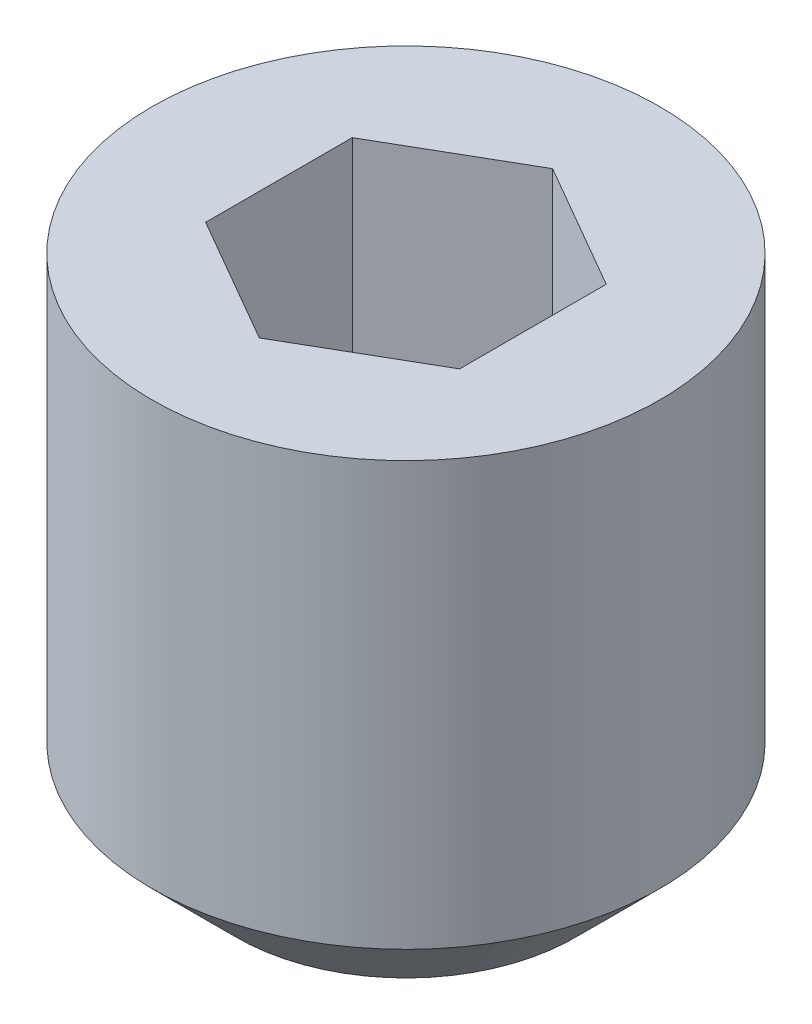
ISO-10303-21;
HEADER;
FILE_DESCRIPTION(('STEP AP214'),'2;1');
FILE_NAME('part.step','',(''),(''),'','','');
FILE_SCHEMA(('AUTOMOTIVE_DESIGN { 1 0 10303 214 1 1 1 1 }'));
ENDSEC;
DATA;
#1=APPLICATION_CONTEXT('core data for automotive mechanical design processes');
#2=APPLICATION_PROTOCOL_DEFINITION('international standard','automotive_design',2000,#1);
#3=PRODUCT_CONTEXT('',#1,'mechanical');
#4=PRODUCT('Part','Part','',(#3));
#5=PRODUCT_RELATED_PRODUCT_CATEGORY('part','',(#4));
#6=PRODUCT_DEFINITION_FORMATION('','',#4);
#7=PRODUCT_DEFINITION_CONTEXT('part definition',#1,'design');
#8=PRODUCT_DEFINITION('design','',#6,#7);
#9=PRODUCT_DEFINITION_SHAPE('','',#8);
#10=(LENGTH_UNIT() NAMED_UNIT(*) SI_UNIT(.MILLI.,.METRE.));
#11=(NAMED_UNIT(*) PLANE_ANGLE_UNIT() SI_UNIT($,.RADIAN.));
#12=(NAMED_UNIT(*) SI_UNIT($,.STERADIAN.) SOLID_ANGLE_UNIT());
#13=UNCERTAINTY_MEASURE_WITH_UNIT(LENGTH_MEASURE(1.E-05),#10,'distance_accuracy_value','');
#14=(GEOMETRIC_REPRESENTATION_CONTEXT(3) GLOBAL_UNCERTAINTY_ASSIGNED_CONTEXT((#13)) GLOBAL_UNIT_ASSIGNED_CONTEXT((#10,
#11,#12)) REPRESENTATION_CONTEXT('',''));
#15=CARTESIAN_POINT('',(0.,0.,0.));
#16=DIRECTION('',(0.,0.,1.));
#17=DIRECTION('',(1.,0.,0.));
#18=AXIS2_PLACEMENT_3D('',#15,#16,#17);
#19=CARTESIAN_POINT('',(0.,3.,0.));
#20=DIRECTION('',(0.,1.,0.));
#21=DIRECTION('',(-1.,0.,0.));
#22=AXIS2_PLACEMENT_3D('',#19,#20,#21);
#23=CYLINDRICAL_SURFACE('',#22,1.5);
#24=CARTESIAN_POINT('',(0.,3.,0.));
#25=DIRECTION('',(0.,1.,0.));
#26=DIRECTION('',(-1.,0.,0.));
#27=AXIS2_PLACEMENT_3D('',#24,#25,#26);
#28=CIRCLE('',#27,1.5);
#29=CARTESIAN_POINT('',(-1.5,3.,0.));
#30=VERTEX_POINT('',#29);
#31=EDGE_CURVE('E11',#30,#30,#28,.T.);
#32=ORIENTED_EDGE('',*,*,#31,.F.);
#33=EDGE_LOOP('',(#32));
#34=FACE_BOUND('',#33,.T.);
#35=CARTESIAN_POINT('',(0.,0.499999999999995,0.));
#36=DIRECTION('',(0.,1.,0.));
#37=DIRECTION('',(-1.,0.,0.));
#38=AXIS2_PLACEMENT_3D('',#35,#36,#37);
#39=CIRCLE('',#38,1.5);
#40=CARTESIAN_POINT('',(-1.5,0.499999999999995,0.));
#41=VERTEX_POINT('',#40);
#42=EDGE_CURVE('E152',#41,#41,#39,.T.);
#43=ORIENTED_EDGE('',*,*,#42,.T.);
#44=EDGE_LOOP('',(#43));
#45=FACE_BOUND('',#44,.T.);
#46=ADVANCED_FACE('F36',(#34,#45),#23,.T.);
#47=CARTESIAN_POINT('',(0.,3.,0.));
#48=DIRECTION('',(0.,-1.,0.));
#49=DIRECTION('',(1.,0.,0.));
#50=AXIS2_PLACEMENT_3D('',#47,#48,#49);
#51=PLANE('',#50);
#52=ORIENTED_EDGE('',*,*,#31,.T.);
#53=EDGE_LOOP('',(#52));
#54=FACE_BOUND('',#53,.T.);
#55=DIRECTION('',(-0.866025403784438,0.,0.5));
#56=VECTOR('',#55,1.);
#57=CARTESIAN_POINT('',(0.,3.,-0.866025403784438));
#58=LINE('',#57,#56);
#59=CARTESIAN_POINT('',(0.,3.,-0.866025403784439));
#60=VERTEX_POINT('',#59);
#61=CARTESIAN_POINT('',(-0.75,3.,-0.433012701892219));
#62=VERTEX_POINT('',#61);
#63=EDGE_CURVE('E151',#60,#62,#58,.T.);
#64=ORIENTED_EDGE('',*,*,#63,.F.);
#65=DIRECTION('',(-0.866025403784439,0.,-0.5));
#66=VECTOR('',#65,1.);
#67=CARTESIAN_POINT('',(0.75,3.,-0.43301270189222));
#68=LINE('',#67,#66);
#69=CARTESIAN_POINT('',(0.75,3.,-0.43301270189222));
#70=VERTEX_POINT('',#69);
#71=EDGE_CURVE('E51',#70,#60,#68,.T.);
#72=ORIENTED_EDGE('',*,*,#71,.F.);
#73=DIRECTION('',(0.,0.,-1.));
#74=VECTOR('',#73,1.);
#75=CARTESIAN_POINT('',(0.75,3.,0.433012701892219));
#76=LINE('',#75,#74);
#77=CARTESIAN_POINT('',(0.75,3.,0.433012701892219));
#78=VERTEX_POINT('',#77);
#79=EDGE_CURVE('E121',#78,#70,#76,.T.);
#80=ORIENTED_EDGE('',*,*,#79,.F.);
#81=DIRECTION('',(0.866025403784439,0.,-0.5));
#82=VECTOR('',#81,1.);
#83=CARTESIAN_POINT('',(0.,3.,0.866025403784438));
#84=LINE('',#83,#82);
#85=CARTESIAN_POINT('',(0.,3.,0.866025403784438));
#86=VERTEX_POINT('',#85);
#87=EDGE_CURVE('E159',#86,#78,#84,.T.);
#88=ORIENTED_EDGE('',*,*,#87,.F.);
#89=DIRECTION('',(0.866025403784439,0.,0.5));
#90=VECTOR('',#89,1.);
#91=CARTESIAN_POINT('',(-0.75,3.,0.433012701892219));
#92=LINE('',#91,#90);
#93=CARTESIAN_POINT('',(-0.75,3.,0.433012701892219));
#94=VERTEX_POINT('',#93);
#95=EDGE_CURVE('E156',#94,#86,#92,.T.);
#96=ORIENTED_EDGE('',*,*,#95,.F.);
#97=DIRECTION('',(0.,0.,1.));
#98=VECTOR('',#97,1.);
#99=CARTESIAN_POINT('',(-0.75,3.,-0.433012701892219));
#100=LINE('',#99,#98);
#101=EDGE_CURVE('E154',#62,#94,#100,.T.);
#102=ORIENTED_EDGE('',*,*,#101,.F.);
#103=EDGE_LOOP('',(#64,#72,#80,#88,#96,#102));
#104=FACE_BOUND('',#103,.T.);
#105=ADVANCED_FACE('F201',(#54,#104),#51,.F.);
#106=CARTESIAN_POINT('',(0.75,1.8,-0.43301270189222));
#107=DIRECTION('',(0.5,0.,-0.866025403784439));
#108=DIRECTION('',(-0.866025403784439,0.,-0.5));
#109=AXIS2_PLACEMENT_3D('',#106,#107,#108);
#110=PLANE('',#109);
#111=DIRECTION('',(-0.866025403784439,0.,-0.5));
#112=VECTOR('',#111,1.);
#113=CARTESIAN_POINT('',(0.75,1.8,-0.43301270189222));
#114=LINE('',#113,#112);
#115=CARTESIAN_POINT('',(0.75,1.8,-0.43301270189222));
#116=VERTEX_POINT('',#115);
#117=CARTESIAN_POINT('',(0.375,1.8,-0.649519052838329));
#118=VERTEX_POINT('',#117);
#119=EDGE_CURVE('E120',#116,#118,#114,.T.);
#120=ORIENTED_EDGE('',*,*,#119,.F.);
#121=DIRECTION('',(0.,1.,0.));
#122=VECTOR('',#121,1.);
#123=CARTESIAN_POINT('',(0.75,1.8,-0.43301270189222));
#124=LINE('',#123,#122);
#125=EDGE_CURVE('E162',#116,#70,#124,.T.);
#126=ORIENTED_EDGE('',*,*,#125,.T.);
#127=ORIENTED_EDGE('',*,*,#71,.T.);
#128=DIRECTION('',(0.,1.,0.));
#129=VECTOR('',#128,1.);
#130=CARTESIAN_POINT('',(0.,1.8,-0.866025403784438));
#131=LINE('',#130,#129);
#132=CARTESIAN_POINT('',(0.,1.8,-0.866025403784438));
#133=VERTEX_POINT('',#132);
#134=EDGE_CURVE('E123',#133,#60,#131,.T.);
#135=ORIENTED_EDGE('',*,*,#134,.F.);
#136=EDGE_CURVE('E112',#118,#133,#114,.T.);
#137=ORIENTED_EDGE('',*,*,#136,.F.);
#138=EDGE_LOOP('',(#120,#126,#127,#135,#137));
#139=FACE_BOUND('',#138,.T.);
#140=ADVANCED_FACE('F124',(#139),#110,.F.);
#141=CARTESIAN_POINT('',(0.75,1.8,0.433012701892219));
#142=DIRECTION('',(1.,0.,0.));
#143=DIRECTION('',(0.,1.,0.));
#144=AXIS2_PLACEMENT_3D('',#141,#142,#143);
#145=PLANE('',#144);
#146=DIRECTION('',(0.,0.,-1.));
#147=VECTOR('',#146,1.);
#148=CARTESIAN_POINT('',(0.75,1.8,0.433012701892219));
#149=LINE('',#148,#147);
#150=CARTESIAN_POINT('',(0.75,1.8,0.433012701892219));
#151=VERTEX_POINT('',#150);
#152=CARTESIAN_POINT('',(0.75,1.8,0.));
#153=VERTEX_POINT('',#152);
#154=EDGE_CURVE('E128',#151,#153,#149,.T.);
#155=ORIENTED_EDGE('',*,*,#154,.F.);
#156=DIRECTION('',(0.,1.,0.));
#157=VECTOR('',#156,1.);
#158=CARTESIAN_POINT('',(0.75,1.8,0.433012701892219));
#159=LINE('',#158,#157);
#160=EDGE_CURVE('E165',#151,#78,#159,.T.);
#161=ORIENTED_EDGE('',*,*,#160,.T.);
#162=ORIENTED_EDGE('',*,*,#79,.T.);
#163=ORIENTED_EDGE('',*,*,#125,.F.);
#164=EDGE_CURVE('E147',#153,#116,#149,.T.);
#165=ORIENTED_EDGE('',*,*,#164,.F.);
#166=EDGE_LOOP('',(#155,#161,#162,#163,#165));
#167=FACE_BOUND('',#166,.T.);
#168=ADVANCED_FACE('F193',(#167),#145,.F.);
#169=CARTESIAN_POINT('',(0.,1.8,0.866025403784438));
#170=DIRECTION('',(0.5,0.,0.866025403784439));
#171=DIRECTION('',(0.866025403784439,0.,-0.5));
#172=AXIS2_PLACEMENT_3D('',#169,#170,#171);
#173=PLANE('',#172);
#174=DIRECTION('',(0.866025403784439,0.,-0.5));
#175=VECTOR('',#174,1.);
#176=CARTESIAN_POINT('',(0.,1.8,0.866025403784438));
#177=LINE('',#176,#175);
#178=CARTESIAN_POINT('',(0.,1.8,0.866025403784438));
#179=VERTEX_POINT('',#178);
#180=CARTESIAN_POINT('',(0.375,1.8,0.649519052838329));
#181=VERTEX_POINT('',#180);
#182=EDGE_CURVE('E59',#179,#181,#177,.T.);
#183=ORIENTED_EDGE('',*,*,#182,.F.);
#184=DIRECTION('',(0.,1.,0.));
#185=VECTOR('',#184,1.);
#186=CARTESIAN_POINT('',(0.,1.8,0.866025403784438));
#187=LINE('',#186,#185);
#188=EDGE_CURVE('E168',#179,#86,#187,.T.);
#189=ORIENTED_EDGE('',*,*,#188,.T.);
#190=ORIENTED_EDGE('',*,*,#87,.T.);
#191=ORIENTED_EDGE('',*,*,#160,.F.);
#192=EDGE_CURVE('E145',#181,#151,#177,.T.);
#193=ORIENTED_EDGE('',*,*,#192,.F.);
#194=EDGE_LOOP('',(#183,#189,#190,#191,#193));
#195=FACE_BOUND('',#194,.T.);
#196=ADVANCED_FACE('F198',(#195),#173,.F.);
#197=CARTESIAN_POINT('',(-0.75,1.8,0.433012701892219));
#198=DIRECTION('',(-0.5,0.,0.866025403784439));
#199=DIRECTION('',(0.866025403784439,0.,0.5));
#200=AXIS2_PLACEMENT_3D('',#197,#198,#199);
#201=PLANE('',#200);
#202=DIRECTION('',(0.866025403784439,0.,0.5));
#203=VECTOR('',#202,1.);
#204=CARTESIAN_POINT('',(-0.75,1.8,0.433012701892219));
#205=LINE('',#204,#203);
#206=CARTESIAN_POINT('',(-0.75,1.8,0.433012701892219));
#207=VERTEX_POINT('',#206);
#208=CARTESIAN_POINT('',(-0.375,1.8,0.649519052838329));
#209=VERTEX_POINT('',#208);
#210=EDGE_CURVE('E142',#207,#209,#205,.T.);
#211=ORIENTED_EDGE('',*,*,#210,.F.);
#212=DIRECTION('',(0.,1.,0.));
#213=VECTOR('',#212,1.);
#214=CARTESIAN_POINT('',(-0.75,1.8,0.433012701892219));
#215=LINE('',#214,#213);
#216=EDGE_CURVE('E171',#207,#94,#215,.T.);
#217=ORIENTED_EDGE('',*,*,#216,.T.);
#218=ORIENTED_EDGE('',*,*,#95,.T.);
#219=ORIENTED_EDGE('',*,*,#188,.F.);
#220=EDGE_CURVE('E141',#209,#179,#205,.T.);
#221=ORIENTED_EDGE('',*,*,#220,.F.);
#222=EDGE_LOOP('',(#211,#217,#218,#219,#221));
#223=FACE_BOUND('',#222,.T.);
#224=ADVANCED_FACE('F241',(#223),#201,.F.);
#225=CARTESIAN_POINT('',(-0.75,1.8,-0.433012701892219));
#226=DIRECTION('',(-1.,0.,0.));
#227=DIRECTION('',(0.,0.,1.));
#228=AXIS2_PLACEMENT_3D('',#225,#226,#227);
#229=PLANE('',#228);
#230=DIRECTION('',(0.,0.,1.));
#231=VECTOR('',#230,1.);
#232=CARTESIAN_POINT('',(-0.75,1.8,-0.433012701892219));
#233=LINE('',#232,#231);
#234=CARTESIAN_POINT('',(-0.75,1.8,-0.433012701892219));
#235=VERTEX_POINT('',#234);
#236=CARTESIAN_POINT('',(-0.75,1.8,0.));
#237=VERTEX_POINT('',#236);
#238=EDGE_CURVE('E136',#235,#237,#233,.T.);
#239=ORIENTED_EDGE('',*,*,#238,.F.);
#240=DIRECTION('',(0.,1.,0.));
#241=VECTOR('',#240,1.);
#242=CARTESIAN_POINT('',(-0.75,1.8,-0.433012701892219));
#243=LINE('',#242,#241);
#244=EDGE_CURVE('E127',#235,#62,#243,.T.);
#245=ORIENTED_EDGE('',*,*,#244,.T.);
#246=ORIENTED_EDGE('',*,*,#101,.T.);
#247=ORIENTED_EDGE('',*,*,#216,.F.);
#248=EDGE_CURVE('E134',#237,#207,#233,.T.);
#249=ORIENTED_EDGE('',*,*,#248,.F.);
#250=EDGE_LOOP('',(#239,#245,#246,#247,#249));
#251=FACE_BOUND('',#250,.T.);
#252=ADVANCED_FACE('F206',(#251),#229,.F.);
#253=CARTESIAN_POINT('',(0.,1.8,-0.866025403784438));
#254=DIRECTION('',(-0.5,0.,-0.866025403784439));
#255=DIRECTION('',(-0.866025403784439,0.,0.5));
#256=AXIS2_PLACEMENT_3D('',#253,#254,#255);
#257=PLANE('',#256);
#258=DIRECTION('',(-0.866025403784438,0.,0.5));
#259=VECTOR('',#258,1.);
#260=CARTESIAN_POINT('',(0.,1.8,-0.866025403784438));
#261=LINE('',#260,#259);
#262=CARTESIAN_POINT('',(-0.375,1.8,-0.649519052838329));
#263=VERTEX_POINT('',#262);
#264=EDGE_CURVE('E115',#133,#263,#261,.T.);
#265=ORIENTED_EDGE('',*,*,#264,.F.);
#266=ORIENTED_EDGE('',*,*,#134,.T.);
#267=ORIENTED_EDGE('',*,*,#63,.T.);
#268=ORIENTED_EDGE('',*,*,#244,.F.);
#269=EDGE_CURVE('E133',#263,#235,#261,.T.);
#270=ORIENTED_EDGE('',*,*,#269,.F.);
#271=EDGE_LOOP('',(#265,#266,#267,#268,#270));
#272=FACE_BOUND('',#271,.T.);
#273=ADVANCED_FACE('F131',(#272),#257,.F.);
#274=CARTESIAN_POINT('',(0.,1.8,0.));
#275=DIRECTION('',(0.,1.,0.));
#276=DIRECTION('',(0.,0.,1.));
#277=AXIS2_PLACEMENT_3D('',#274,#275,#276);
#278=PLANE('',#277);
#279=ORIENTED_EDGE('',*,*,#192,.T.);
#280=ORIENTED_EDGE('',*,*,#154,.T.);
#281=CARTESIAN_POINT('',(0.,1.8,0.));
#282=DIRECTION('',(0.,1.,0.));
#283=DIRECTION('',(0.,0.,1.));
#284=AXIS2_PLACEMENT_3D('',#281,#282,#283);
#285=CIRCLE('',#284,0.75);
#286=EDGE_CURVE('E44',#181,#153,#285,.T.);
#287=ORIENTED_EDGE('',*,*,#286,.F.);
#288=EDGE_LOOP('',(#279,#280,#287));
#289=FACE_BOUND('',#288,.T.);
#290=ADVANCED_FACE('F195',(#289),#278,.T.);
#291=ORIENTED_EDGE('',*,*,#164,.T.);
#292=ORIENTED_EDGE('',*,*,#119,.T.);
#293=EDGE_CURVE('E176',#153,#118,#285,.T.);
#294=ORIENTED_EDGE('',*,*,#293,.F.);
#295=EDGE_LOOP('',(#291,#292,#294));
#296=FACE_BOUND('',#295,.T.);
#297=ADVANCED_FACE('F189',(#296),#278,.T.);
#298=ORIENTED_EDGE('',*,*,#136,.T.);
#299=ORIENTED_EDGE('',*,*,#264,.T.);
#300=EDGE_CURVE('E117',#118,#263,#285,.T.);
#301=ORIENTED_EDGE('',*,*,#300,.F.);
#302=EDGE_LOOP('',(#298,#299,#301));
#303=FACE_BOUND('',#302,.T.);
#304=ADVANCED_FACE('F113',(#303),#278,.T.);
#305=ORIENTED_EDGE('',*,*,#269,.T.);
#306=ORIENTED_EDGE('',*,*,#238,.T.);
#307=EDGE_CURVE('E183',#263,#237,#285,.T.);
#308=ORIENTED_EDGE('',*,*,#307,.F.);
#309=EDGE_LOOP('',(#305,#306,#308));
#310=FACE_BOUND('',#309,.T.);
#311=ADVANCED_FACE('F210',(#310),#278,.T.);
#312=ORIENTED_EDGE('',*,*,#248,.T.);
#313=ORIENTED_EDGE('',*,*,#210,.T.);
#314=EDGE_CURVE('E181',#237,#209,#285,.T.);
#315=ORIENTED_EDGE('',*,*,#314,.F.);
#316=EDGE_LOOP('',(#312,#313,#315));
#317=FACE_BOUND('',#316,.T.);
#318=ADVANCED_FACE('F212',(#317),#278,.T.);
#319=ORIENTED_EDGE('',*,*,#220,.T.);
#320=ORIENTED_EDGE('',*,*,#182,.T.);
#321=EDGE_CURVE('E164',#209,#181,#285,.T.);
#322=ORIENTED_EDGE('',*,*,#321,.F.);
#323=EDGE_LOOP('',(#319,#320,#322));
#324=FACE_BOUND('',#323,.T.);
#325=ADVANCED_FACE('F218',(#324),#278,.T.);
#326=CARTESIAN_POINT('',(0.,1.36698729810778,0.));
#327=DIRECTION('',(0.,1.,0.));
#328=DIRECTION('',(0.,0.,1.));
#329=AXIS2_PLACEMENT_3D('',#326,#327,#328);
#330=CONICAL_SURFACE('',#329,0.,1.04719755119659);
#331=ORIENTED_EDGE('',*,*,#286,.T.);
#332=ORIENTED_EDGE('',*,*,#293,.T.);
#333=ORIENTED_EDGE('',*,*,#300,.T.);
#334=ORIENTED_EDGE('',*,*,#307,.T.);
#335=ORIENTED_EDGE('',*,*,#314,.T.);
#336=ORIENTED_EDGE('',*,*,#321,.T.);
#337=EDGE_LOOP('',(#331,#332,#333,#334,#335,#336));
#338=FACE_BOUND('',#337,.T.);
#339=CARTESIAN_POINT('',(0.,1.36698729810778,0.));
#340=VERTEX_POINT('',#339);
#341=VERTEX_LOOP('',#340);
#342=FACE_BOUND('',#341,.T.);
#343=ADVANCED_FACE('F185',(#338,#342),#330,.F.);
#344=CARTESIAN_POINT('',(0.,0.499999999999995,0.));
#345=DIRECTION('',(0.,1.,0.));
#346=DIRECTION('',(-1.,0.,0.));
#347=AXIS2_PLACEMENT_3D('',#344,#345,#346);
#348=CONICAL_SURFACE('',#347,1.5,0.785398163397453);
#349=CARTESIAN_POINT('',(0.,0.,0.));
#350=DIRECTION('',(0.,1.,0.));
#351=DIRECTION('',(-1.,0.,0.));
#352=AXIS2_PLACEMENT_3D('',#349,#350,#351);
#353=CIRCLE('',#352,1.);
#354=CARTESIAN_POINT('',(-1.,0.,0.));
#355=VERTEX_POINT('',#354);
#356=EDGE_CURVE('E334',#355,#355,#353,.T.);
#357=ORIENTED_EDGE('',*,*,#356,.T.);
#358=EDGE_LOOP('',(#357));
#359=FACE_BOUND('',#358,.T.);
#360=ORIENTED_EDGE('',*,*,#42,.F.);
#361=EDGE_LOOP('',(#360));
#362=FACE_BOUND('',#361,.T.);
#363=ADVANCED_FACE('F234',(#359,#362),#348,.T.);
#364=CARTESIAN_POINT('',(0.,0.,0.));
#365=DIRECTION('',(0.,1.,0.));
#366=DIRECTION('',(-1.,0.,0.));
#367=AXIS2_PLACEMENT_3D('',#364,#365,#366);
#368=PLANE('',#367);
#369=ORIENTED_EDGE('',*,*,#356,.F.);
#370=EDGE_LOOP('',(#369));
#371=FACE_BOUND('',#370,.T.);
#372=ADVANCED_FACE('F38',(#371),#368,.F.);
#373=CLOSED_SHELL('',(#46,#105,#140,#168,#196,#224,#252,#273,#290,#297,#304,#311,#318,#325,#343,
#363,#372));
#374=MANIFOLD_SOLID_BREP('B2',#373);
#375=ADVANCED_BREP_SHAPE_REPRESENTATION('',(#18,#374),#14);
#376=SHAPE_DEFINITION_REPRESENTATION(#9,#375);
ENDSEC;
END-ISO-10303-21;
